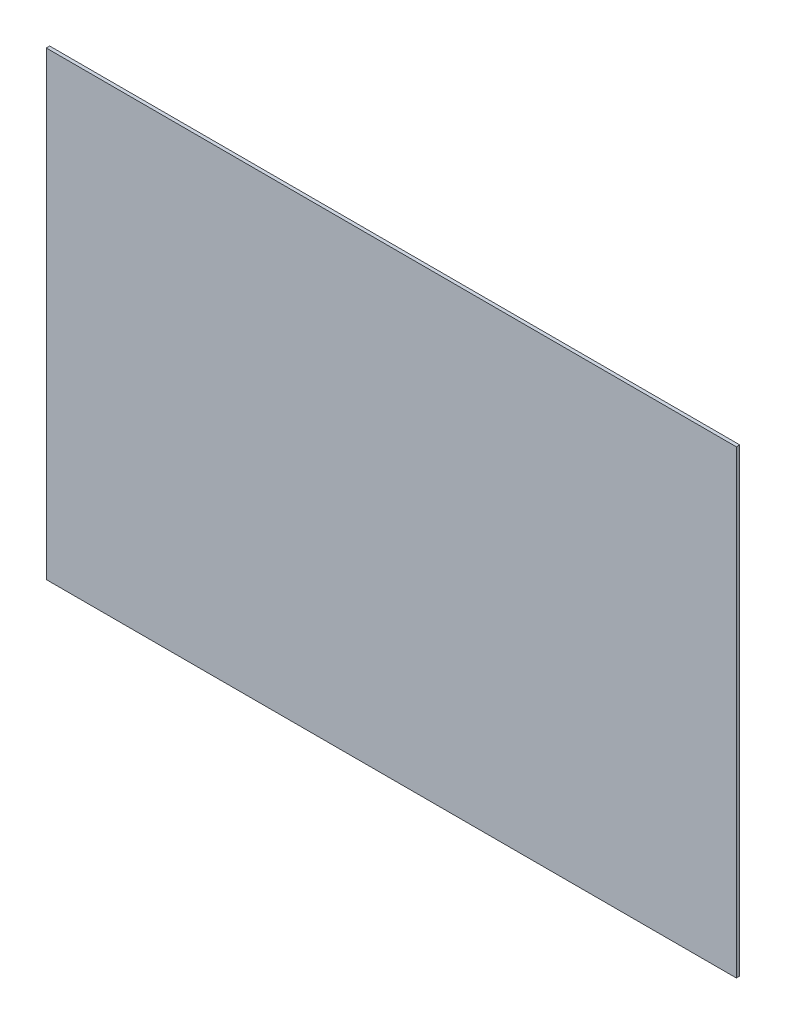
ISO-10303-21;
HEADER;
FILE_DESCRIPTION(('STEP AP214'),'2;1');
FILE_NAME('part.step','',(''),(''),'','','');
FILE_SCHEMA(('AUTOMOTIVE_DESIGN { 1 0 10303 214 1 1 1 1 }'));
ENDSEC;
DATA;
#1=APPLICATION_CONTEXT('core data for automotive mechanical design processes');
#2=APPLICATION_PROTOCOL_DEFINITION('international standard','automotive_design',2000,#1);
#3=PRODUCT_CONTEXT('',#1,'mechanical');
#4=PRODUCT('Part','Part','',(#3));
#5=PRODUCT_RELATED_PRODUCT_CATEGORY('part','',(#4));
#6=PRODUCT_DEFINITION_FORMATION('','',#4);
#7=PRODUCT_DEFINITION_CONTEXT('part definition',#1,'design');
#8=PRODUCT_DEFINITION('design','',#6,#7);
#9=PRODUCT_DEFINITION_SHAPE('','',#8);
#10=(LENGTH_UNIT() NAMED_UNIT(*) SI_UNIT(.MILLI.,.METRE.));
#11=(NAMED_UNIT(*) PLANE_ANGLE_UNIT() SI_UNIT($,.RADIAN.));
#12=(NAMED_UNIT(*) SI_UNIT($,.STERADIAN.) SOLID_ANGLE_UNIT());
#13=UNCERTAINTY_MEASURE_WITH_UNIT(LENGTH_MEASURE(1.E-05),#10,'distance_accuracy_value','');
#14=(GEOMETRIC_REPRESENTATION_CONTEXT(3) GLOBAL_UNCERTAINTY_ASSIGNED_CONTEXT((#13)) GLOBAL_UNIT_ASSIGNED_CONTEXT((#10,
#11,#12)) REPRESENTATION_CONTEXT('',''));
#15=CARTESIAN_POINT('',(0.,0.,0.));
#16=DIRECTION('',(0.,0.,1.));
#17=DIRECTION('',(1.,0.,0.));
#18=AXIS2_PLACEMENT_3D('',#15,#16,#17);
#19=CARTESIAN_POINT('',(25.4,25.4,1.12776));
#20=DIRECTION('',(0.,0.,-1.));
#21=DIRECTION('',(-1.,0.,0.));
#22=AXIS2_PLACEMENT_3D('',#19,#20,#21);
#23=PLANE('',#22);
#24=DIRECTION('',(0.,1.,0.));
#25=VECTOR('',#24,1.);
#26=CARTESIAN_POINT('',(254.,25.4,1.12776));
#27=LINE('',#26,#25);
#28=CARTESIAN_POINT('',(254.,25.4,1.12776));
#29=VERTEX_POINT('',#28);
#30=CARTESIAN_POINT('',(254.,177.8,1.12776));
#31=VERTEX_POINT('',#30);
#32=EDGE_CURVE('E53',#29,#31,#27,.T.);
#33=ORIENTED_EDGE('',*,*,#32,.T.);
#34=DIRECTION('',(0.999999845679048,-0.000555555469821627,0.));
#35=VECTOR('',#34,1.);
#36=CARTESIAN_POINT('',(254.,177.8,1.12776));
#37=LINE('',#36,#35);
#38=CARTESIAN_POINT('',(25.4,177.927,1.12776));
#39=VERTEX_POINT('',#38);
#40=EDGE_CURVE('E55',#31,#39,#37,.F.);
#41=ORIENTED_EDGE('',*,*,#40,.T.);
#42=DIRECTION('',(0.,1.,0.));
#43=VECTOR('',#42,1.);
#44=CARTESIAN_POINT('',(25.4,177.927,1.12776));
#45=LINE('',#44,#43);
#46=CARTESIAN_POINT('',(25.4,25.4,1.12776));
#47=VERTEX_POINT('',#46);
#48=EDGE_CURVE('E18',#39,#47,#45,.F.);
#49=ORIENTED_EDGE('',*,*,#48,.T.);
#50=DIRECTION('',(1.,0.,0.));
#51=VECTOR('',#50,1.);
#52=CARTESIAN_POINT('',(25.4,25.4,1.12776));
#53=LINE('',#52,#51);
#54=EDGE_CURVE('E78',#47,#29,#53,.T.);
#55=ORIENTED_EDGE('',*,*,#54,.T.);
#56=EDGE_LOOP('',(#33,#41,#49,#55));
#57=FACE_BOUND('',#56,.T.);
#58=ADVANCED_FACE('F15',(#57),#23,.F.);
#59=CARTESIAN_POINT('',(25.4,177.927,0.));
#60=DIRECTION('',(1.,0.,0.));
#61=DIRECTION('',(0.,0.,-1.));
#62=AXIS2_PLACEMENT_3D('',#59,#60,#61);
#63=PLANE('',#62);
#64=DIRECTION('',(0.,0.,1.));
#65=VECTOR('',#64,1.);
#66=CARTESIAN_POINT('',(25.4,25.4,0.));
#67=LINE('',#66,#65);
#68=CARTESIAN_POINT('',(25.4,25.4,0.));
#69=VERTEX_POINT('',#68);
#70=EDGE_CURVE('E66',#69,#47,#67,.T.);
#71=ORIENTED_EDGE('',*,*,#70,.T.);
#72=ORIENTED_EDGE('',*,*,#48,.F.);
#73=DIRECTION('',(0.,0.,1.));
#74=VECTOR('',#73,1.);
#75=CARTESIAN_POINT('',(25.4,177.927,0.));
#76=LINE('',#75,#74);
#77=CARTESIAN_POINT('',(25.4,177.927,0.));
#78=VERTEX_POINT('',#77);
#79=EDGE_CURVE('E61',#39,#78,#76,.F.);
#80=ORIENTED_EDGE('',*,*,#79,.T.);
#81=DIRECTION('',(0.,1.,0.));
#82=VECTOR('',#81,1.);
#83=CARTESIAN_POINT('',(25.4,25.4,0.));
#84=LINE('',#83,#82);
#85=EDGE_CURVE('E81',#69,#78,#84,.T.);
#86=ORIENTED_EDGE('',*,*,#85,.F.);
#87=EDGE_LOOP('',(#71,#72,#80,#86));
#88=FACE_BOUND('',#87,.T.);
#89=ADVANCED_FACE('F63',(#88),#63,.F.);
#90=CARTESIAN_POINT('',(254.,177.8,0.));
#91=DIRECTION('',(-0.000555555469821627,-0.999999845679048,0.));
#92=DIRECTION('',(0.999999845679048,-0.000555555469821627,0.));
#93=AXIS2_PLACEMENT_3D('',#90,#91,#92);
#94=PLANE('',#93);
#95=ORIENTED_EDGE('',*,*,#79,.F.);
#96=ORIENTED_EDGE('',*,*,#40,.F.);
#97=DIRECTION('',(0.,0.,1.));
#98=VECTOR('',#97,1.);
#99=CARTESIAN_POINT('',(254.,177.8,0.));
#100=LINE('',#99,#98);
#101=CARTESIAN_POINT('',(254.,177.8,0.));
#102=VERTEX_POINT('',#101);
#103=EDGE_CURVE('E73',#31,#102,#100,.F.);
#104=ORIENTED_EDGE('',*,*,#103,.T.);
#105=DIRECTION('',(0.999999845679048,-0.000555555469821642,0.));
#106=VECTOR('',#105,1.);
#107=CARTESIAN_POINT('',(25.4,177.927,0.));
#108=LINE('',#107,#106);
#109=EDGE_CURVE('E70',#78,#102,#108,.T.);
#110=ORIENTED_EDGE('',*,*,#109,.F.);
#111=EDGE_LOOP('',(#95,#96,#104,#110));
#112=FACE_BOUND('',#111,.T.);
#113=ADVANCED_FACE('F68',(#112),#94,.F.);
#114=CARTESIAN_POINT('',(254.,25.4,0.));
#115=DIRECTION('',(-1.,0.,0.));
#116=DIRECTION('',(0.,0.,1.));
#117=AXIS2_PLACEMENT_3D('',#114,#115,#116);
#118=PLANE('',#117);
#119=ORIENTED_EDGE('',*,*,#103,.F.);
#120=ORIENTED_EDGE('',*,*,#32,.F.);
#121=DIRECTION('',(0.,0.,1.));
#122=VECTOR('',#121,1.);
#123=CARTESIAN_POINT('',(254.,25.4,0.));
#124=LINE('',#123,#122);
#125=CARTESIAN_POINT('',(254.,25.4,0.));
#126=VERTEX_POINT('',#125);
#127=EDGE_CURVE('E33',#29,#126,#124,.F.);
#128=ORIENTED_EDGE('',*,*,#127,.T.);
#129=DIRECTION('',(0.,1.,0.));
#130=VECTOR('',#129,1.);
#131=CARTESIAN_POINT('',(254.,25.4,0.));
#132=LINE('',#131,#130);
#133=EDGE_CURVE('E24',#102,#126,#132,.F.);
#134=ORIENTED_EDGE('',*,*,#133,.F.);
#135=EDGE_LOOP('',(#119,#120,#128,#134));
#136=FACE_BOUND('',#135,.T.);
#137=ADVANCED_FACE('F87',(#136),#118,.F.);
#138=CARTESIAN_POINT('',(25.4,25.4,0.));
#139=DIRECTION('',(0.,1.,0.));
#140=DIRECTION('',(0.,0.,1.));
#141=AXIS2_PLACEMENT_3D('',#138,#139,#140);
#142=PLANE('',#141);
#143=ORIENTED_EDGE('',*,*,#127,.F.);
#144=ORIENTED_EDGE('',*,*,#54,.F.);
#145=ORIENTED_EDGE('',*,*,#70,.F.);
#146=DIRECTION('',(-1.,0.,0.));
#147=VECTOR('',#146,1.);
#148=CARTESIAN_POINT('',(25.4,25.4,0.));
#149=LINE('',#148,#147);
#150=EDGE_CURVE('E10',#126,#69,#149,.T.);
#151=ORIENTED_EDGE('',*,*,#150,.F.);
#152=EDGE_LOOP('',(#143,#144,#145,#151));
#153=FACE_BOUND('',#152,.T.);
#154=ADVANCED_FACE('F89',(#153),#142,.F.);
#155=CARTESIAN_POINT('',(25.4,25.4,0.));
#156=DIRECTION('',(0.,0.,-1.));
#157=DIRECTION('',(-1.,0.,0.));
#158=AXIS2_PLACEMENT_3D('',#155,#156,#157);
#159=PLANE('',#158);
#160=ORIENTED_EDGE('',*,*,#133,.T.);
#161=ORIENTED_EDGE('',*,*,#150,.T.);
#162=ORIENTED_EDGE('',*,*,#85,.T.);
#163=ORIENTED_EDGE('',*,*,#109,.T.);
#164=EDGE_LOOP('',(#160,#161,#162,#163));
#165=FACE_BOUND('',#164,.T.);
#166=ADVANCED_FACE('F86',(#165),#159,.T.);
#167=CLOSED_SHELL('',(#58,#89,#113,#137,#154,#166));
#168=MANIFOLD_SOLID_BREP('B1',#167);
#169=ADVANCED_BREP_SHAPE_REPRESENTATION('',(#18,#168),#14);
#170=SHAPE_DEFINITION_REPRESENTATION(#9,#169);
ENDSEC;
END-ISO-10303-21;
